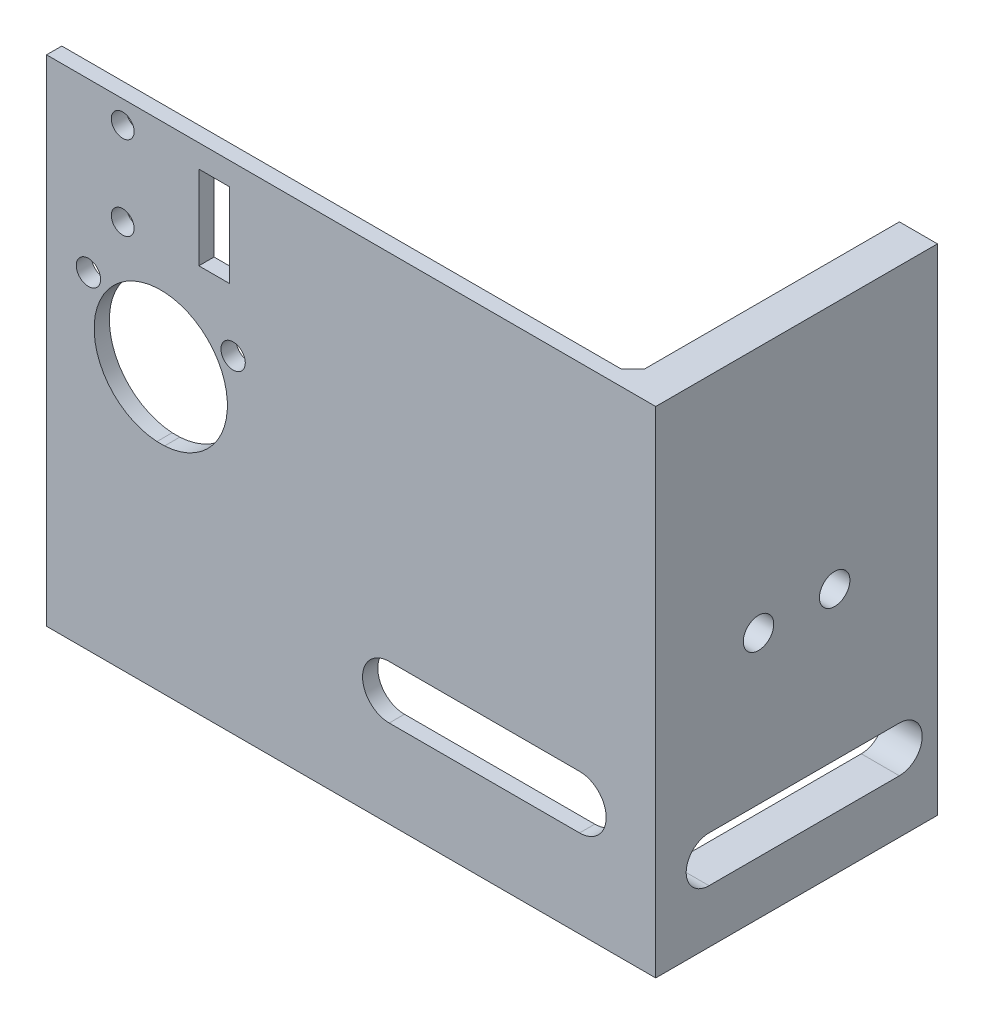
ISO-10303-21;
HEADER;
FILE_DESCRIPTION(('STEP AP214'),'2;1');
FILE_NAME('part.step','',(''),(''),'','','');
FILE_SCHEMA(('AUTOMOTIVE_DESIGN { 1 0 10303 214 1 1 1 1 }'));
ENDSEC;
DATA;
#1=APPLICATION_CONTEXT('core data for automotive mechanical design processes');
#2=APPLICATION_PROTOCOL_DEFINITION('international standard','automotive_design',2000,#1);
#3=PRODUCT_CONTEXT('',#1,'mechanical');
#4=PRODUCT('Part','Part','',(#3));
#5=PRODUCT_RELATED_PRODUCT_CATEGORY('part','',(#4));
#6=PRODUCT_DEFINITION_FORMATION('','',#4);
#7=PRODUCT_DEFINITION_CONTEXT('part definition',#1,'design');
#8=PRODUCT_DEFINITION('design','',#6,#7);
#9=PRODUCT_DEFINITION_SHAPE('','',#8);
#10=(LENGTH_UNIT() NAMED_UNIT(*) SI_UNIT(.MILLI.,.METRE.));
#11=(NAMED_UNIT(*) PLANE_ANGLE_UNIT() SI_UNIT($,.RADIAN.));
#12=(NAMED_UNIT(*) SI_UNIT($,.STERADIAN.) SOLID_ANGLE_UNIT());
#13=UNCERTAINTY_MEASURE_WITH_UNIT(LENGTH_MEASURE(1.E-05),#10,'distance_accuracy_value','');
#14=(GEOMETRIC_REPRESENTATION_CONTEXT(3) GLOBAL_UNCERTAINTY_ASSIGNED_CONTEXT((#13)) GLOBAL_UNIT_ASSIGNED_CONTEXT((#10,
#11,#12)) REPRESENTATION_CONTEXT('',''));
#15=CARTESIAN_POINT('',(0.,0.,0.));
#16=DIRECTION('',(0.,0.,1.));
#17=DIRECTION('',(1.,0.,0.));
#18=AXIS2_PLACEMENT_3D('',#15,#16,#17);
#19=CARTESIAN_POINT('',(0.,13.,-2.));
#20=DIRECTION('',(0.,0.,1.));
#21=DIRECTION('',(1.,0.,0.));
#22=AXIS2_PLACEMENT_3D('',#19,#20,#21);
#23=CYLINDRICAL_SURFACE('',#22,8.75);
#24=DIRECTION('',(0.,0.,1.));
#25=VECTOR('',#24,1.);
#26=CARTESIAN_POINT('',(0.500000000000004,21.7357026048281,-2.));
#27=LINE('',#26,#25);
#28=CARTESIAN_POINT('',(0.500000000000004,21.7357026048281,0.));
#29=VERTEX_POINT('',#28);
#30=CARTESIAN_POINT('',(0.500000000000004,21.7357026048281,-2.));
#31=VERTEX_POINT('',#30);
#32=EDGE_CURVE('E266',#29,#31,#27,.F.);
#33=ORIENTED_EDGE('',*,*,#32,.T.);
#34=CARTESIAN_POINT('',(0.,13.,-2.));
#35=DIRECTION('',(0.,0.,1.));
#36=DIRECTION('',(1.,0.,0.));
#37=AXIS2_PLACEMENT_3D('',#34,#35,#36);
#38=CIRCLE('',#37,8.75);
#39=CARTESIAN_POINT('',(0.499999999999977,4.26429739517194,-2.));
#40=VERTEX_POINT('',#39);
#41=EDGE_CURVE('E315',#40,#31,#38,.T.);
#42=ORIENTED_EDGE('',*,*,#41,.F.);
#43=DIRECTION('',(0.,0.,1.));
#44=VECTOR('',#43,1.);
#45=CARTESIAN_POINT('',(0.499999999999977,4.26429739517194,-1.99999999999999));
#46=LINE('',#45,#44);
#47=CARTESIAN_POINT('',(0.499999999999977,4.26429739517194,0.));
#48=VERTEX_POINT('',#47);
#49=EDGE_CURVE('E332',#40,#48,#46,.T.);
#50=ORIENTED_EDGE('',*,*,#49,.T.);
#51=CARTESIAN_POINT('',(0.,13.,0.));
#52=DIRECTION('',(0.,0.,1.));
#53=DIRECTION('',(1.,0.,0.));
#54=AXIS2_PLACEMENT_3D('',#51,#52,#53);
#55=CIRCLE('',#54,8.75);
#56=EDGE_CURVE('E320',#48,#29,#55,.T.);
#57=ORIENTED_EDGE('',*,*,#56,.T.);
#58=EDGE_LOOP('',(#33,#42,#50,#57));
#59=FACE_BOUND('',#58,.T.);
#60=ADVANCED_FACE('F41',(#59),#23,.F.);
#61=CARTESIAN_POINT('',(-9.5,19.,-2.));
#62=DIRECTION('',(0.,0.,1.));
#63=DIRECTION('',(1.,0.,0.));
#64=AXIS2_PLACEMENT_3D('',#61,#62,#63);
#65=CYLINDRICAL_SURFACE('',#64,1.6);
#66=CARTESIAN_POINT('',(-9.5,19.,-2.));
#67=DIRECTION('',(0.,0.,1.));
#68=DIRECTION('',(1.,0.,0.));
#69=AXIS2_PLACEMENT_3D('',#66,#67,#68);
#70=CIRCLE('',#69,1.6);
#71=CARTESIAN_POINT('',(-7.9,19.,-2.));
#72=VERTEX_POINT('',#71);
#73=EDGE_CURVE('E355',#72,#72,#70,.T.);
#74=ORIENTED_EDGE('',*,*,#73,.F.);
#75=EDGE_LOOP('',(#74));
#76=FACE_BOUND('',#75,.T.);
#77=CARTESIAN_POINT('',(-9.5,19.,0.));
#78=DIRECTION('',(0.,0.,1.));
#79=DIRECTION('',(1.,0.,0.));
#80=AXIS2_PLACEMENT_3D('',#77,#78,#79);
#81=CIRCLE('',#80,1.6);
#82=CARTESIAN_POINT('',(-7.9,19.,0.));
#83=VERTEX_POINT('',#82);
#84=EDGE_CURVE('E352',#83,#83,#81,.T.);
#85=ORIENTED_EDGE('',*,*,#84,.T.);
#86=EDGE_LOOP('',(#85));
#87=FACE_BOUND('',#86,.T.);
#88=ADVANCED_FACE('F435',(#76,#87),#65,.F.);
#89=CARTESIAN_POINT('',(-15.,24.,-2.));
#90=DIRECTION('',(-1.,0.,0.));
#91=DIRECTION('',(0.,-1.,0.));
#92=AXIS2_PLACEMENT_3D('',#89,#90,#91);
#93=PLANE('',#92);
#94=DIRECTION('',(0.,-1.,0.));
#95=VECTOR('',#94,1.);
#96=CARTESIAN_POINT('',(-15.,24.,0.));
#97=LINE('',#96,#95);
#98=CARTESIAN_POINT('',(-15.,41.,0.));
#99=VERTEX_POINT('',#98);
#100=CARTESIAN_POINT('',(-15.,-24.,0.));
#101=VERTEX_POINT('',#100);
#102=EDGE_CURVE('E358',#99,#101,#97,.T.);
#103=ORIENTED_EDGE('',*,*,#102,.F.);
#104=DIRECTION('',(0.,0.,1.));
#105=VECTOR('',#104,1.);
#106=CARTESIAN_POINT('',(-15.,41.,-2.));
#107=LINE('',#106,#105);
#108=CARTESIAN_POINT('',(-15.,41.,-2.));
#109=VERTEX_POINT('',#108);
#110=EDGE_CURVE('E341',#109,#99,#107,.T.);
#111=ORIENTED_EDGE('',*,*,#110,.F.);
#112=DIRECTION('',(0.,-1.,0.));
#113=VECTOR('',#112,1.);
#114=CARTESIAN_POINT('',(-15.,24.,-2.));
#115=LINE('',#114,#113);
#116=CARTESIAN_POINT('',(-15.,-24.,-2.));
#117=VERTEX_POINT('',#116);
#118=EDGE_CURVE('E361',#109,#117,#115,.T.);
#119=ORIENTED_EDGE('',*,*,#118,.T.);
#120=DIRECTION('',(0.,0.,1.));
#121=VECTOR('',#120,1.);
#122=CARTESIAN_POINT('',(-15.,-24.,-2.));
#123=LINE('',#122,#121);
#124=EDGE_CURVE('E368',#117,#101,#123,.T.);
#125=ORIENTED_EDGE('',*,*,#124,.T.);
#126=EDGE_LOOP('',(#103,#111,#119,#125));
#127=FACE_BOUND('',#126,.T.);
#128=ADVANCED_FACE('F441',(#127),#93,.T.);
#129=CARTESIAN_POINT('',(0.,13.,-2.));
#130=DIRECTION('',(0.,0.,1.));
#131=DIRECTION('',(1.,0.,0.));
#132=AXIS2_PLACEMENT_3D('',#129,#130,#131);
#133=CYLINDRICAL_SURFACE('',#132,8.75);
#134=CARTESIAN_POINT('',(0.,13.,0.));
#135=DIRECTION('',(0.,0.,1.));
#136=DIRECTION('',(1.,0.,0.));
#137=AXIS2_PLACEMENT_3D('',#134,#135,#136);
#138=CIRCLE('',#137,8.75);
#139=CARTESIAN_POINT('',(-0.5,21.7357026048281,0.));
#140=VERTEX_POINT('',#139);
#141=CARTESIAN_POINT('',(-0.5,4.26429739517194,0.));
#142=VERTEX_POINT('',#141);
#143=EDGE_CURVE('E348',#140,#142,#138,.T.);
#144=ORIENTED_EDGE('',*,*,#143,.T.);
#145=DIRECTION('',(0.,0.,1.));
#146=VECTOR('',#145,1.);
#147=CARTESIAN_POINT('',(-0.5,4.26429739517194,-2.));
#148=LINE('',#147,#146);
#149=CARTESIAN_POINT('',(-0.5,4.26429739517194,-2.));
#150=VERTEX_POINT('',#149);
#151=EDGE_CURVE('E338',#142,#150,#148,.F.);
#152=ORIENTED_EDGE('',*,*,#151,.T.);
#153=CARTESIAN_POINT('',(0.,13.,-2.));
#154=DIRECTION('',(0.,0.,1.));
#155=DIRECTION('',(1.,0.,0.));
#156=AXIS2_PLACEMENT_3D('',#153,#154,#155);
#157=CIRCLE('',#156,8.75);
#158=CARTESIAN_POINT('',(-0.5,21.7357026048281,-2.));
#159=VERTEX_POINT('',#158);
#160=EDGE_CURVE('E349',#159,#150,#157,.T.);
#161=ORIENTED_EDGE('',*,*,#160,.F.);
#162=DIRECTION('',(0.,0.,1.));
#163=VECTOR('',#162,1.);
#164=CARTESIAN_POINT('',(-0.5,21.7357026048281,-2.));
#165=LINE('',#164,#163);
#166=EDGE_CURVE('E335',#159,#140,#165,.T.);
#167=ORIENTED_EDGE('',*,*,#166,.T.);
#168=EDGE_LOOP('',(#144,#152,#161,#167));
#169=FACE_BOUND('',#168,.T.);
#170=ADVANCED_FACE('F456',(#169),#133,.F.);
#171=CARTESIAN_POINT('',(0.,41.,0.));
#172=DIRECTION('',(0.,1.,0.));
#173=DIRECTION('',(0.,0.,1.));
#174=AXIS2_PLACEMENT_3D('',#171,#172,#173);
#175=PLANE('',#174);
#176=DIRECTION('',(1.,0.,0.));
#177=VECTOR('',#176,1.);
#178=CARTESIAN_POINT('',(-15.,41.,0.));
#179=LINE('',#178,#177);
#180=CARTESIAN_POINT('',(65.,41.,0.));
#181=VERTEX_POINT('',#180);
#182=EDGE_CURVE('E344',#99,#181,#179,.T.);
#183=ORIENTED_EDGE('',*,*,#182,.T.);
#184=DIRECTION('',(0.,0.,1.));
#185=VECTOR('',#184,1.);
#186=CARTESIAN_POINT('',(65.,41.,-2.));
#187=LINE('',#186,#185);
#188=CARTESIAN_POINT('',(65.,41.,-37.));
#189=VERTEX_POINT('',#188);
#190=EDGE_CURVE('E304',#189,#181,#187,.T.);
#191=ORIENTED_EDGE('',*,*,#190,.F.);
#192=DIRECTION('',(1.,0.,0.));
#193=VECTOR('',#192,1.);
#194=CARTESIAN_POINT('',(65.,41.,-37.));
#195=LINE('',#194,#193);
#196=CARTESIAN_POINT('',(60.,41.,-37.));
#197=VERTEX_POINT('',#196);
#198=EDGE_CURVE('E289',#197,#189,#195,.T.);
#199=ORIENTED_EDGE('',*,*,#198,.F.);
#200=DIRECTION('',(0.,0.,1.));
#201=VECTOR('',#200,1.);
#202=CARTESIAN_POINT('',(60.,41.,-37.));
#203=LINE('',#202,#201);
#204=CARTESIAN_POINT('',(60.,41.,-3.50000000000002));
#205=VERTEX_POINT('',#204);
#206=EDGE_CURVE('E301',#197,#205,#203,.T.);
#207=ORIENTED_EDGE('',*,*,#206,.T.);
#208=DIRECTION('',(0.707106781186546,0.,-0.707106781186549));
#209=VECTOR('',#208,1.);
#210=CARTESIAN_POINT('',(60.,41.,-3.50000000000002));
#211=LINE('',#210,#209);
#212=CARTESIAN_POINT('',(58.5,41.,-2.));
#213=VERTEX_POINT('',#212);
#214=EDGE_CURVE('E405',#205,#213,#211,.F.);
#215=ORIENTED_EDGE('',*,*,#214,.T.);
#216=DIRECTION('',(-1.,0.,0.));
#217=VECTOR('',#216,1.);
#218=CARTESIAN_POINT('',(15.,41.,-2.));
#219=LINE('',#218,#217);
#220=EDGE_CURVE('E346',#213,#109,#219,.T.);
#221=ORIENTED_EDGE('',*,*,#220,.T.);
#222=ORIENTED_EDGE('',*,*,#110,.T.);
#223=EDGE_LOOP('',(#183,#191,#199,#207,#215,#221,#222));
#224=FACE_BOUND('',#223,.T.);
#225=ADVANCED_FACE('F453',(#224),#175,.T.);
#226=CARTESIAN_POINT('',(0.,0.,0.));
#227=DIRECTION('',(0.,0.,1.));
#228=DIRECTION('',(1.,0.,0.));
#229=AXIS2_PLACEMENT_3D('',#226,#227,#228);
#230=PLANE('',#229);
#231=DIRECTION('',(0.,-1.,0.));
#232=VECTOR('',#231,1.);
#233=CARTESIAN_POINT('',(5.,38.,0.));
#234=LINE('',#233,#232);
#235=CARTESIAN_POINT('',(5.,38.,0.));
#236=VERTEX_POINT('',#235);
#237=CARTESIAN_POINT('',(5.,27.,0.));
#238=VERTEX_POINT('',#237);
#239=EDGE_CURVE('E57',#236,#238,#234,.T.);
#240=ORIENTED_EDGE('',*,*,#239,.F.);
#241=DIRECTION('',(-1.,0.,0.));
#242=VECTOR('',#241,1.);
#243=CARTESIAN_POINT('',(5.,38.,0.));
#244=LINE('',#243,#242);
#245=CARTESIAN_POINT('',(9.,38.,0.));
#246=VERTEX_POINT('',#245);
#247=EDGE_CURVE('E207',#246,#236,#244,.T.);
#248=ORIENTED_EDGE('',*,*,#247,.F.);
#249=DIRECTION('',(0.,1.,0.));
#250=VECTOR('',#249,1.);
#251=CARTESIAN_POINT('',(9.,38.,0.));
#252=LINE('',#251,#250);
#253=CARTESIAN_POINT('',(9.,27.,0.));
#254=VERTEX_POINT('',#253);
#255=EDGE_CURVE('E213',#254,#246,#252,.T.);
#256=ORIENTED_EDGE('',*,*,#255,.F.);
#257=DIRECTION('',(1.,0.,0.));
#258=VECTOR('',#257,1.);
#259=CARTESIAN_POINT('',(5.,27.,0.));
#260=LINE('',#259,#258);
#261=EDGE_CURVE('E219',#238,#254,#260,.T.);
#262=ORIENTED_EDGE('',*,*,#261,.F.);
#263=EDGE_LOOP('',(#240,#248,#256,#262));
#264=FACE_BOUND('',#263,.T.);
#265=CARTESIAN_POINT('',(-5.,27.,0.));
#266=DIRECTION('',(0.,0.,1.));
#267=DIRECTION('',(1.,0.,0.));
#268=AXIS2_PLACEMENT_3D('',#265,#266,#267);
#269=CIRCLE('',#268,1.5);
#270=CARTESIAN_POINT('',(-3.5,27.,0.));
#271=VERTEX_POINT('',#270);
#272=EDGE_CURVE('E220',#271,#271,#269,.T.);
#273=ORIENTED_EDGE('',*,*,#272,.F.);
#274=EDGE_LOOP('',(#273));
#275=FACE_BOUND('',#274,.T.);
#276=CARTESIAN_POINT('',(-5.,38.,0.));
#277=DIRECTION('',(0.,0.,1.));
#278=DIRECTION('',(1.,0.,0.));
#279=AXIS2_PLACEMENT_3D('',#276,#277,#278);
#280=CIRCLE('',#279,1.5);
#281=CARTESIAN_POINT('',(-3.5,38.,0.));
#282=VERTEX_POINT('',#281);
#283=EDGE_CURVE('E223',#282,#282,#280,.T.);
#284=ORIENTED_EDGE('',*,*,#283,.F.);
#285=EDGE_LOOP('',(#284));
#286=FACE_BOUND('',#285,.T.);
#287=CARTESIAN_POINT('',(30.,-9.,0.));
#288=DIRECTION('',(0.,0.,1.));
#289=DIRECTION('',(1.,0.,0.));
#290=AXIS2_PLACEMENT_3D('',#287,#288,#289);
#291=CIRCLE('',#290,3.5);
#292=CARTESIAN_POINT('',(30.,-5.5,0.));
#293=VERTEX_POINT('',#292);
#294=CARTESIAN_POINT('',(30.,-12.5,0.));
#295=VERTEX_POINT('',#294);
#296=EDGE_CURVE('E246',#293,#295,#291,.T.);
#297=ORIENTED_EDGE('',*,*,#296,.F.);
#298=DIRECTION('',(-1.,0.,0.));
#299=VECTOR('',#298,1.);
#300=CARTESIAN_POINT('',(30.,-5.5,0.));
#301=LINE('',#300,#299);
#302=CARTESIAN_POINT('',(55.,-5.5,0.));
#303=VERTEX_POINT('',#302);
#304=EDGE_CURVE('E260',#303,#293,#301,.T.);
#305=ORIENTED_EDGE('',*,*,#304,.F.);
#306=CARTESIAN_POINT('',(55.,-9.,0.));
#307=DIRECTION('',(0.,0.,1.));
#308=DIRECTION('',(1.,0.,0.));
#309=AXIS2_PLACEMENT_3D('',#306,#307,#308);
#310=CIRCLE('',#309,3.5);
#311=CARTESIAN_POINT('',(55.,-12.5,0.));
#312=VERTEX_POINT('',#311);
#313=EDGE_CURVE('E257',#312,#303,#310,.T.);
#314=ORIENTED_EDGE('',*,*,#313,.F.);
#315=DIRECTION('',(1.,0.,0.));
#316=VECTOR('',#315,1.);
#317=CARTESIAN_POINT('',(30.,-12.5,0.));
#318=LINE('',#317,#316);
#319=EDGE_CURVE('E254',#295,#312,#318,.T.);
#320=ORIENTED_EDGE('',*,*,#319,.F.);
#321=EDGE_LOOP('',(#297,#305,#314,#320));
#322=FACE_BOUND('',#321,.T.);
#323=ORIENTED_EDGE('',*,*,#143,.F.);
#324=DIRECTION('',(-1.,0.,0.));
#325=VECTOR('',#324,1.);
#326=CARTESIAN_POINT('',(65.002,21.7357026048281,0.));
#327=LINE('',#326,#325);
#328=EDGE_CURVE('E275',#29,#140,#327,.T.);
#329=ORIENTED_EDGE('',*,*,#328,.F.);
#330=ORIENTED_EDGE('',*,*,#56,.F.);
#331=DIRECTION('',(-1.,0.,0.));
#332=VECTOR('',#331,1.);
#333=CARTESIAN_POINT('',(65.002,4.26429739517194,0.));
#334=LINE('',#333,#332);
#335=EDGE_CURVE('E330',#48,#142,#334,.T.);
#336=ORIENTED_EDGE('',*,*,#335,.T.);
#337=EDGE_LOOP('',(#323,#329,#330,#336));
#338=FACE_BOUND('',#337,.T.);
#339=DIRECTION('',(0.,-1.,0.));
#340=VECTOR('',#339,1.);
#341=CARTESIAN_POINT('',(65.,41.,0.));
#342=LINE('',#341,#340);
#343=CARTESIAN_POINT('',(65.,-24.,0.));
#344=VERTEX_POINT('',#343);
#345=EDGE_CURVE('E307',#181,#344,#342,.T.);
#346=ORIENTED_EDGE('',*,*,#345,.F.);
#347=ORIENTED_EDGE('',*,*,#182,.F.);
#348=ORIENTED_EDGE('',*,*,#102,.T.);
#349=DIRECTION('',(1.,0.,0.));
#350=VECTOR('',#349,1.);
#351=CARTESIAN_POINT('',(-15.,-24.,0.));
#352=LINE('',#351,#350);
#353=EDGE_CURVE('E365',#101,#344,#352,.T.);
#354=ORIENTED_EDGE('',*,*,#353,.T.);
#355=EDGE_LOOP('',(#346,#347,#348,#354));
#356=FACE_BOUND('',#355,.T.);
#357=ORIENTED_EDGE('',*,*,#84,.F.);
#358=EDGE_LOOP('',(#357));
#359=FACE_BOUND('',#358,.T.);
#360=CARTESIAN_POINT('',(9.50000000000001,19.,0.));
#361=DIRECTION('',(0.,0.,1.));
#362=DIRECTION('',(1.,0.,0.));
#363=AXIS2_PLACEMENT_3D('',#360,#361,#362);
#364=CIRCLE('',#363,1.6);
#365=CARTESIAN_POINT('',(11.1,19.,0.));
#366=VERTEX_POINT('',#365);
#367=EDGE_CURVE('E316',#366,#366,#364,.T.);
#368=ORIENTED_EDGE('',*,*,#367,.F.);
#369=EDGE_LOOP('',(#368));
#370=FACE_BOUND('',#369,.T.);
#371=ADVANCED_FACE('F217',(#264,#275,#286,#322,#338,#356,#359,#370),#230,.T.);
#372=CARTESIAN_POINT('',(0.,0.,-2.));
#373=DIRECTION('',(0.,0.,1.));
#374=DIRECTION('',(1.,0.,0.));
#375=AXIS2_PLACEMENT_3D('',#372,#373,#374);
#376=PLANE('',#375);
#377=DIRECTION('',(-1.,0.,0.));
#378=VECTOR('',#377,1.);
#379=CARTESIAN_POINT('',(0.,38.,-2.));
#380=LINE('',#379,#378);
#381=CARTESIAN_POINT('',(9.,38.,-2.));
#382=VERTEX_POINT('',#381);
#383=CARTESIAN_POINT('',(5.,38.,-2.));
#384=VERTEX_POINT('',#383);
#385=EDGE_CURVE('E50',#382,#384,#380,.T.);
#386=ORIENTED_EDGE('',*,*,#385,.T.);
#387=DIRECTION('',(0.,-1.,0.));
#388=VECTOR('',#387,1.);
#389=CARTESIAN_POINT('',(5.,0.,-2.));
#390=LINE('',#389,#388);
#391=CARTESIAN_POINT('',(5.,27.,-2.));
#392=VERTEX_POINT('',#391);
#393=EDGE_CURVE('E11',#384,#392,#390,.T.);
#394=ORIENTED_EDGE('',*,*,#393,.T.);
#395=DIRECTION('',(1.,0.,0.));
#396=VECTOR('',#395,1.);
#397=CARTESIAN_POINT('',(0.,27.,-2.));
#398=LINE('',#397,#396);
#399=CARTESIAN_POINT('',(9.,27.,-2.));
#400=VERTEX_POINT('',#399);
#401=EDGE_CURVE('E409',#392,#400,#398,.T.);
#402=ORIENTED_EDGE('',*,*,#401,.T.);
#403=DIRECTION('',(0.,1.,0.));
#404=VECTOR('',#403,1.);
#405=CARTESIAN_POINT('',(9.,0.,-2.));
#406=LINE('',#405,#404);
#407=EDGE_CURVE('E416',#400,#382,#406,.T.);
#408=ORIENTED_EDGE('',*,*,#407,.T.);
#409=EDGE_LOOP('',(#386,#394,#402,#408));
#410=FACE_BOUND('',#409,.T.);
#411=CARTESIAN_POINT('',(-5.,27.,-2.));
#412=DIRECTION('',(0.,0.,1.));
#413=DIRECTION('',(1.,0.,0.));
#414=AXIS2_PLACEMENT_3D('',#411,#412,#413);
#415=CIRCLE('',#414,1.5);
#416=CARTESIAN_POINT('',(-3.5,27.,-2.));
#417=VERTEX_POINT('',#416);
#418=EDGE_CURVE('E234',#417,#417,#415,.T.);
#419=ORIENTED_EDGE('',*,*,#418,.T.);
#420=EDGE_LOOP('',(#419));
#421=FACE_BOUND('',#420,.T.);
#422=CARTESIAN_POINT('',(-5.,38.,-2.));
#423=DIRECTION('',(0.,0.,1.));
#424=DIRECTION('',(1.,0.,0.));
#425=AXIS2_PLACEMENT_3D('',#422,#423,#424);
#426=CIRCLE('',#425,1.5);
#427=CARTESIAN_POINT('',(-3.5,38.,-2.));
#428=VERTEX_POINT('',#427);
#429=EDGE_CURVE('E230',#428,#428,#426,.T.);
#430=ORIENTED_EDGE('',*,*,#429,.T.);
#431=EDGE_LOOP('',(#430));
#432=FACE_BOUND('',#431,.T.);
#433=ORIENTED_EDGE('',*,*,#220,.F.);
#434=DIRECTION('',(0.,-1.,0.));
#435=VECTOR('',#434,1.);
#436=CARTESIAN_POINT('',(58.5,-24.,-2.));
#437=LINE('',#436,#435);
#438=CARTESIAN_POINT('',(58.5,-9.,-2.));
#439=VERTEX_POINT('',#438);
#440=EDGE_CURVE('E403',#213,#439,#437,.T.);
#441=ORIENTED_EDGE('',*,*,#440,.T.);
#442=CARTESIAN_POINT('',(55.,-9.,-2.));
#443=DIRECTION('',(0.,0.,1.));
#444=DIRECTION('',(1.,0.,0.));
#445=AXIS2_PLACEMENT_3D('',#442,#443,#444);
#446=CIRCLE('',#445,3.5);
#447=CARTESIAN_POINT('',(55.,-5.5,-2.));
#448=VERTEX_POINT('',#447);
#449=EDGE_CURVE('E376',#439,#448,#446,.T.);
#450=ORIENTED_EDGE('',*,*,#449,.T.);
#451=DIRECTION('',(-1.,0.,0.));
#452=VECTOR('',#451,1.);
#453=CARTESIAN_POINT('',(0.,-5.5,-2.));
#454=LINE('',#453,#452);
#455=CARTESIAN_POINT('',(30.,-5.5,-2.));
#456=VERTEX_POINT('',#455);
#457=EDGE_CURVE('E380',#448,#456,#454,.T.);
#458=ORIENTED_EDGE('',*,*,#457,.T.);
#459=CARTESIAN_POINT('',(30.,-9.,-2.));
#460=DIRECTION('',(0.,0.,1.));
#461=DIRECTION('',(1.,0.,0.));
#462=AXIS2_PLACEMENT_3D('',#459,#460,#461);
#463=CIRCLE('',#462,3.5);
#464=CARTESIAN_POINT('',(30.,-12.5,-2.));
#465=VERTEX_POINT('',#464);
#466=EDGE_CURVE('E383',#456,#465,#463,.T.);
#467=ORIENTED_EDGE('',*,*,#466,.T.);
#468=DIRECTION('',(1.,0.,0.));
#469=VECTOR('',#468,1.);
#470=CARTESIAN_POINT('',(0.,-12.5,-2.));
#471=LINE('',#470,#469);
#472=CARTESIAN_POINT('',(55.,-12.5,-2.));
#473=VERTEX_POINT('',#472);
#474=EDGE_CURVE('E373',#465,#473,#471,.T.);
#475=ORIENTED_EDGE('',*,*,#474,.T.);
#476=EDGE_CURVE('E377',#473,#439,#446,.T.);
#477=ORIENTED_EDGE('',*,*,#476,.T.);
#478=DIRECTION('',(0.,-1.,0.));
#479=VECTOR('',#478,1.);
#480=CARTESIAN_POINT('',(58.5,-24.,-2.));
#481=LINE('',#480,#479);
#482=CARTESIAN_POINT('',(58.5,-24.,-2.));
#483=VERTEX_POINT('',#482);
#484=EDGE_CURVE('E401',#439,#483,#481,.T.);
#485=ORIENTED_EDGE('',*,*,#484,.T.);
#486=DIRECTION('',(1.,0.,0.));
#487=VECTOR('',#486,1.);
#488=CARTESIAN_POINT('',(-15.,-24.,-2.));
#489=LINE('',#488,#487);
#490=EDGE_CURVE('E364',#117,#483,#489,.T.);
#491=ORIENTED_EDGE('',*,*,#490,.F.);
#492=ORIENTED_EDGE('',*,*,#118,.F.);
#493=EDGE_LOOP('',(#433,#441,#450,#458,#467,#475,#477,#485,#491,#492));
#494=FACE_BOUND('',#493,.T.);
#495=DIRECTION('',(-1.,0.,0.));
#496=VECTOR('',#495,1.);
#497=CARTESIAN_POINT('',(65.002,21.7357026048281,-2.));
#498=LINE('',#497,#496);
#499=EDGE_CURVE('E273',#31,#159,#498,.T.);
#500=ORIENTED_EDGE('',*,*,#499,.T.);
#501=ORIENTED_EDGE('',*,*,#160,.T.);
#502=DIRECTION('',(-1.,0.,0.));
#503=VECTOR('',#502,1.);
#504=CARTESIAN_POINT('',(65.002,4.26429739517194,-2.));
#505=LINE('',#504,#503);
#506=EDGE_CURVE('E319',#40,#150,#505,.T.);
#507=ORIENTED_EDGE('',*,*,#506,.F.);
#508=ORIENTED_EDGE('',*,*,#41,.T.);
#509=EDGE_LOOP('',(#500,#501,#507,#508));
#510=FACE_BOUND('',#509,.T.);
#511=ORIENTED_EDGE('',*,*,#73,.T.);
#512=EDGE_LOOP('',(#511));
#513=FACE_BOUND('',#512,.T.);
#514=CARTESIAN_POINT('',(9.50000000000001,19.,-2.));
#515=DIRECTION('',(0.,0.,1.));
#516=DIRECTION('',(1.,0.,0.));
#517=AXIS2_PLACEMENT_3D('',#514,#515,#516);
#518=CIRCLE('',#517,1.6);
#519=CARTESIAN_POINT('',(11.1,19.,-2.));
#520=VERTEX_POINT('',#519);
#521=EDGE_CURVE('E312',#520,#520,#518,.T.);
#522=ORIENTED_EDGE('',*,*,#521,.T.);
#523=EDGE_LOOP('',(#522));
#524=FACE_BOUND('',#523,.T.);
#525=ADVANCED_FACE('F419',(#410,#421,#432,#494,#510,#513,#524),#376,.F.);
#526=CARTESIAN_POINT('',(-15.,-24.,-2.));
#527=DIRECTION('',(0.,-1.,0.));
#528=DIRECTION('',(0.,0.,-1.));
#529=AXIS2_PLACEMENT_3D('',#526,#527,#528);
#530=PLANE('',#529);
#531=ORIENTED_EDGE('',*,*,#490,.T.);
#532=DIRECTION('',(-0.707106781186546,0.,0.707106781186549));
#533=VECTOR('',#532,1.);
#534=CARTESIAN_POINT('',(60.,-24.,-3.50000000000002));
#535=LINE('',#534,#533);
#536=CARTESIAN_POINT('',(60.,-24.,-3.50000000000002));
#537=VERTEX_POINT('',#536);
#538=EDGE_CURVE('E407',#483,#537,#535,.F.);
#539=ORIENTED_EDGE('',*,*,#538,.T.);
#540=DIRECTION('',(0.,0.,1.));
#541=VECTOR('',#540,1.);
#542=CARTESIAN_POINT('',(60.,-24.,-37.));
#543=LINE('',#542,#541);
#544=CARTESIAN_POINT('',(60.,-24.,-37.));
#545=VERTEX_POINT('',#544);
#546=EDGE_CURVE('E298',#545,#537,#543,.T.);
#547=ORIENTED_EDGE('',*,*,#546,.F.);
#548=DIRECTION('',(-1.,0.,0.));
#549=VECTOR('',#548,1.);
#550=CARTESIAN_POINT('',(65.,-24.,-37.));
#551=LINE('',#550,#549);
#552=CARTESIAN_POINT('',(65.,-24.,-37.));
#553=VERTEX_POINT('',#552);
#554=EDGE_CURVE('E296',#553,#545,#551,.T.);
#555=ORIENTED_EDGE('',*,*,#554,.F.);
#556=DIRECTION('',(0.,0.,-1.));
#557=VECTOR('',#556,1.);
#558=CARTESIAN_POINT('',(65.,-24.,0.));
#559=LINE('',#558,#557);
#560=EDGE_CURVE('E310',#344,#553,#559,.T.);
#561=ORIENTED_EDGE('',*,*,#560,.F.);
#562=ORIENTED_EDGE('',*,*,#353,.F.);
#563=ORIENTED_EDGE('',*,*,#124,.F.);
#564=EDGE_LOOP('',(#531,#539,#547,#555,#561,#562,#563));
#565=FACE_BOUND('',#564,.T.);
#566=ADVANCED_FACE('F451',(#565),#530,.T.);
#567=CARTESIAN_POINT('',(65.002,4.26429739517194,-2.));
#568=DIRECTION('',(0.,-1.,0.));
#569=DIRECTION('',(0.,0.,-1.));
#570=AXIS2_PLACEMENT_3D('',#567,#568,#569);
#571=PLANE('',#570);
#572=ORIENTED_EDGE('',*,*,#49,.F.);
#573=ORIENTED_EDGE('',*,*,#506,.T.);
#574=ORIENTED_EDGE('',*,*,#151,.F.);
#575=ORIENTED_EDGE('',*,*,#335,.F.);
#576=EDGE_LOOP('',(#572,#573,#574,#575));
#577=FACE_BOUND('',#576,.T.);
#578=ADVANCED_FACE('F448',(#577),#571,.F.);
#579=CARTESIAN_POINT('',(9.50000000000001,19.,-2.));
#580=DIRECTION('',(0.,0.,1.));
#581=DIRECTION('',(1.,0.,0.));
#582=AXIS2_PLACEMENT_3D('',#579,#580,#581);
#583=CYLINDRICAL_SURFACE('',#582,1.6);
#584=ORIENTED_EDGE('',*,*,#521,.F.);
#585=EDGE_LOOP('',(#584));
#586=FACE_BOUND('',#585,.T.);
#587=ORIENTED_EDGE('',*,*,#367,.T.);
#588=EDGE_LOOP('',(#587));
#589=FACE_BOUND('',#588,.T.);
#590=ADVANCED_FACE('F446',(#586,#589),#583,.F.);
#591=CARTESIAN_POINT('',(65.,0.,0.));
#592=DIRECTION('',(1.,0.,0.));
#593=DIRECTION('',(0.,1.,0.));
#594=AXIS2_PLACEMENT_3D('',#591,#592,#593);
#595=PLANE('',#594);
#596=CARTESIAN_POINT('',(65.,-14.,-7.00000000000001));
#597=DIRECTION('',(1.,0.,0.));
#598=DIRECTION('',(0.,1.,0.));
#599=AXIS2_PLACEMENT_3D('',#596,#597,#598);
#600=CIRCLE('',#599,3.);
#601=CARTESIAN_POINT('',(65.,-11.,-7.00000000000001));
#602=VERTEX_POINT('',#601);
#603=CARTESIAN_POINT('',(65.,-17.,-7.00000000000001));
#604=VERTEX_POINT('',#603);
#605=EDGE_CURVE('E231',#602,#604,#600,.T.);
#606=ORIENTED_EDGE('',*,*,#605,.F.);
#607=DIRECTION('',(0.,0.,1.));
#608=VECTOR('',#607,1.);
#609=CARTESIAN_POINT('',(65.,-11.,-7.00000000000001));
#610=LINE('',#609,#608);
#611=CARTESIAN_POINT('',(65.,-11.,-32.));
#612=VERTEX_POINT('',#611);
#613=EDGE_CURVE('E240',#612,#602,#610,.T.);
#614=ORIENTED_EDGE('',*,*,#613,.F.);
#615=CARTESIAN_POINT('',(65.,-14.,-32.));
#616=DIRECTION('',(1.,0.,0.));
#617=DIRECTION('',(0.,1.,0.));
#618=AXIS2_PLACEMENT_3D('',#615,#616,#617);
#619=CIRCLE('',#618,3.);
#620=CARTESIAN_POINT('',(65.,-17.,-32.));
#621=VERTEX_POINT('',#620);
#622=EDGE_CURVE('E237',#621,#612,#619,.T.);
#623=ORIENTED_EDGE('',*,*,#622,.F.);
#624=DIRECTION('',(0.,0.,-1.));
#625=VECTOR('',#624,1.);
#626=CARTESIAN_POINT('',(65.,-17.,-7.00000000000001));
#627=LINE('',#626,#625);
#628=EDGE_CURVE('E233',#604,#621,#627,.T.);
#629=ORIENTED_EDGE('',*,*,#628,.F.);
#630=EDGE_LOOP('',(#606,#614,#623,#629));
#631=FACE_BOUND('',#630,.T.);
#632=CARTESIAN_POINT('',(65.,8.50000000000001,-13.5));
#633=DIRECTION('',(1.,0.,0.));
#634=DIRECTION('',(0.,1.,0.));
#635=AXIS2_PLACEMENT_3D('',#632,#633,#634);
#636=CIRCLE('',#635,2.);
#637=CARTESIAN_POINT('',(65.,10.5,-13.5));
#638=VERTEX_POINT('',#637);
#639=EDGE_CURVE('E280',#638,#638,#636,.T.);
#640=ORIENTED_EDGE('',*,*,#639,.F.);
#641=EDGE_LOOP('',(#640));
#642=FACE_BOUND('',#641,.T.);
#643=CARTESIAN_POINT('',(65.,8.50000000000001,-23.5));
#644=DIRECTION('',(1.,0.,0.));
#645=DIRECTION('',(0.,1.,0.));
#646=AXIS2_PLACEMENT_3D('',#643,#644,#645);
#647=CIRCLE('',#646,2.);
#648=CARTESIAN_POINT('',(65.,10.5,-23.5));
#649=VERTEX_POINT('',#648);
#650=EDGE_CURVE('E277',#649,#649,#647,.T.);
#651=ORIENTED_EDGE('',*,*,#650,.F.);
#652=EDGE_LOOP('',(#651));
#653=FACE_BOUND('',#652,.T.);
#654=ORIENTED_EDGE('',*,*,#190,.T.);
#655=ORIENTED_EDGE('',*,*,#345,.T.);
#656=ORIENTED_EDGE('',*,*,#560,.T.);
#657=DIRECTION('',(0.,-1.,0.));
#658=VECTOR('',#657,1.);
#659=CARTESIAN_POINT('',(65.,41.,-37.));
#660=LINE('',#659,#658);
#661=EDGE_CURVE('E293',#189,#553,#660,.T.);
#662=ORIENTED_EDGE('',*,*,#661,.F.);
#663=EDGE_LOOP('',(#654,#655,#656,#662));
#664=FACE_BOUND('',#663,.T.);
#665=ADVANCED_FACE('F498',(#631,#642,#653,#664),#595,.T.);
#666=CARTESIAN_POINT('',(60.,41.,-37.));
#667=DIRECTION('',(1.,0.,0.));
#668=DIRECTION('',(0.,1.,0.));
#669=AXIS2_PLACEMENT_3D('',#666,#667,#668);
#670=PLANE('',#669);
#671=DIRECTION('',(0.,0.,1.));
#672=VECTOR('',#671,1.);
#673=CARTESIAN_POINT('',(60.,-11.,-37.));
#674=LINE('',#673,#672);
#675=CARTESIAN_POINT('',(60.,-11.,-32.));
#676=VERTEX_POINT('',#675);
#677=CARTESIAN_POINT('',(60.,-11.,-7.00000000000001));
#678=VERTEX_POINT('',#677);
#679=EDGE_CURVE('E392',#676,#678,#674,.T.);
#680=ORIENTED_EDGE('',*,*,#679,.T.);
#681=CARTESIAN_POINT('',(60.,-14.,-7.00000000000001));
#682=DIRECTION('',(1.,0.,0.));
#683=DIRECTION('',(0.,1.,0.));
#684=AXIS2_PLACEMENT_3D('',#681,#682,#683);
#685=CIRCLE('',#684,3.);
#686=CARTESIAN_POINT('',(60.,-17.,-7.00000000000001));
#687=VERTEX_POINT('',#686);
#688=EDGE_CURVE('E395',#678,#687,#685,.T.);
#689=ORIENTED_EDGE('',*,*,#688,.T.);
#690=DIRECTION('',(0.,0.,-1.));
#691=VECTOR('',#690,1.);
#692=CARTESIAN_POINT('',(60.,-17.,-37.));
#693=LINE('',#692,#691);
#694=CARTESIAN_POINT('',(60.,-17.,-32.));
#695=VERTEX_POINT('',#694);
#696=EDGE_CURVE('E386',#687,#695,#693,.T.);
#697=ORIENTED_EDGE('',*,*,#696,.T.);
#698=CARTESIAN_POINT('',(60.,-14.,-32.));
#699=DIRECTION('',(1.,0.,0.));
#700=DIRECTION('',(0.,1.,0.));
#701=AXIS2_PLACEMENT_3D('',#698,#699,#700);
#702=CIRCLE('',#701,3.);
#703=EDGE_CURVE('E389',#695,#676,#702,.T.);
#704=ORIENTED_EDGE('',*,*,#703,.T.);
#705=EDGE_LOOP('',(#680,#689,#697,#704));
#706=FACE_BOUND('',#705,.T.);
#707=CARTESIAN_POINT('',(60.,8.50000000000001,-13.5));
#708=DIRECTION('',(1.,0.,0.));
#709=DIRECTION('',(0.,1.,0.));
#710=AXIS2_PLACEMENT_3D('',#707,#708,#709);
#711=CIRCLE('',#710,2.);
#712=CARTESIAN_POINT('',(60.,10.5,-13.5));
#713=VERTEX_POINT('',#712);
#714=EDGE_CURVE('E290',#713,#713,#711,.T.);
#715=ORIENTED_EDGE('',*,*,#714,.T.);
#716=EDGE_LOOP('',(#715));
#717=FACE_BOUND('',#716,.T.);
#718=CARTESIAN_POINT('',(60.,8.50000000000001,-23.5));
#719=DIRECTION('',(1.,0.,0.));
#720=DIRECTION('',(0.,1.,0.));
#721=AXIS2_PLACEMENT_3D('',#718,#719,#720);
#722=CIRCLE('',#721,2.);
#723=CARTESIAN_POINT('',(60.,10.5,-23.5));
#724=VERTEX_POINT('',#723);
#725=EDGE_CURVE('E283',#724,#724,#722,.T.);
#726=ORIENTED_EDGE('',*,*,#725,.T.);
#727=EDGE_LOOP('',(#726));
#728=FACE_BOUND('',#727,.T.);
#729=ORIENTED_EDGE('',*,*,#546,.T.);
#730=DIRECTION('',(0.,1.,0.));
#731=VECTOR('',#730,1.);
#732=CARTESIAN_POINT('',(60.,41.,-3.50000000000002));
#733=LINE('',#732,#731);
#734=EDGE_CURVE('E398',#537,#205,#733,.T.);
#735=ORIENTED_EDGE('',*,*,#734,.T.);
#736=ORIENTED_EDGE('',*,*,#206,.F.);
#737=DIRECTION('',(0.,1.,0.));
#738=VECTOR('',#737,1.);
#739=CARTESIAN_POINT('',(60.,41.,-37.));
#740=LINE('',#739,#738);
#741=EDGE_CURVE('E286',#545,#197,#740,.T.);
#742=ORIENTED_EDGE('',*,*,#741,.F.);
#743=EDGE_LOOP('',(#729,#735,#736,#742));
#744=FACE_BOUND('',#743,.T.);
#745=ADVANCED_FACE('F490',(#706,#717,#728,#744),#670,.F.);
#746=CARTESIAN_POINT('',(0.,0.,-37.));
#747=DIRECTION('',(0.,0.,-1.));
#748=DIRECTION('',(-1.,0.,0.));
#749=AXIS2_PLACEMENT_3D('',#746,#747,#748);
#750=PLANE('',#749);
#751=ORIENTED_EDGE('',*,*,#741,.T.);
#752=ORIENTED_EDGE('',*,*,#198,.T.);
#753=ORIENTED_EDGE('',*,*,#661,.T.);
#754=ORIENTED_EDGE('',*,*,#554,.T.);
#755=EDGE_LOOP('',(#751,#752,#753,#754));
#756=FACE_BOUND('',#755,.T.);
#757=ADVANCED_FACE('F494',(#756),#750,.T.);
#758=CARTESIAN_POINT('',(30.,8.50000000000001,-23.5));
#759=DIRECTION('',(1.,0.,0.));
#760=DIRECTION('',(0.,1.,0.));
#761=AXIS2_PLACEMENT_3D('',#758,#759,#760);
#762=CYLINDRICAL_SURFACE('',#761,2.);
#763=ORIENTED_EDGE('',*,*,#650,.T.);
#764=EDGE_LOOP('',(#763));
#765=FACE_BOUND('',#764,.T.);
#766=ORIENTED_EDGE('',*,*,#725,.F.);
#767=EDGE_LOOP('',(#766));
#768=FACE_BOUND('',#767,.T.);
#769=ADVANCED_FACE('F513',(#765,#768),#762,.F.);
#770=CARTESIAN_POINT('',(30.,8.5,-13.5));
#771=DIRECTION('',(1.,0.,0.));
#772=DIRECTION('',(0.,1.,0.));
#773=AXIS2_PLACEMENT_3D('',#770,#771,#772);
#774=CYLINDRICAL_SURFACE('',#773,2.);
#775=ORIENTED_EDGE('',*,*,#639,.T.);
#776=EDGE_LOOP('',(#775));
#777=FACE_BOUND('',#776,.T.);
#778=ORIENTED_EDGE('',*,*,#714,.F.);
#779=EDGE_LOOP('',(#778));
#780=FACE_BOUND('',#779,.T.);
#781=ADVANCED_FACE('F516',(#777,#780),#774,.F.);
#782=CARTESIAN_POINT('',(65.002,21.7357026048281,0.));
#783=DIRECTION('',(0.,1.,0.));
#784=DIRECTION('',(0.,0.,1.));
#785=AXIS2_PLACEMENT_3D('',#782,#783,#784);
#786=PLANE('',#785);
#787=ORIENTED_EDGE('',*,*,#32,.F.);
#788=ORIENTED_EDGE('',*,*,#328,.T.);
#789=ORIENTED_EDGE('',*,*,#166,.F.);
#790=ORIENTED_EDGE('',*,*,#499,.F.);
#791=EDGE_LOOP('',(#787,#788,#789,#790));
#792=FACE_BOUND('',#791,.T.);
#793=ADVANCED_FACE('F520',(#792),#786,.F.);
#794=CARTESIAN_POINT('',(30.,-9.,-6.));
#795=DIRECTION('',(0.,0.,1.));
#796=DIRECTION('',(1.,0.,0.));
#797=AXIS2_PLACEMENT_3D('',#794,#795,#796);
#798=CYLINDRICAL_SURFACE('',#797,3.5);
#799=DIRECTION('',(0.,0.,1.));
#800=VECTOR('',#799,1.);
#801=CARTESIAN_POINT('',(30.,-5.5,-6.));
#802=LINE('',#801,#800);
#803=EDGE_CURVE('E264',#456,#293,#802,.T.);
#804=ORIENTED_EDGE('',*,*,#803,.T.);
#805=ORIENTED_EDGE('',*,*,#296,.T.);
#806=DIRECTION('',(0.,0.,1.));
#807=VECTOR('',#806,1.);
#808=CARTESIAN_POINT('',(30.,-12.5,-6.));
#809=LINE('',#808,#807);
#810=EDGE_CURVE('E263',#465,#295,#809,.T.);
#811=ORIENTED_EDGE('',*,*,#810,.F.);
#812=ORIENTED_EDGE('',*,*,#466,.F.);
#813=EDGE_LOOP('',(#804,#805,#811,#812));
#814=FACE_BOUND('',#813,.T.);
#815=ADVANCED_FACE('F524',(#814),#798,.F.);
#816=CARTESIAN_POINT('',(30.,-5.5,-6.));
#817=DIRECTION('',(0.,1.,0.));
#818=DIRECTION('',(0.,0.,1.));
#819=AXIS2_PLACEMENT_3D('',#816,#817,#818);
#820=PLANE('',#819);
#821=DIRECTION('',(0.,0.,1.));
#822=VECTOR('',#821,1.);
#823=CARTESIAN_POINT('',(55.,-5.5,-6.));
#824=LINE('',#823,#822);
#825=EDGE_CURVE('E267',#448,#303,#824,.T.);
#826=ORIENTED_EDGE('',*,*,#825,.T.);
#827=ORIENTED_EDGE('',*,*,#304,.T.);
#828=ORIENTED_EDGE('',*,*,#803,.F.);
#829=ORIENTED_EDGE('',*,*,#457,.F.);
#830=EDGE_LOOP('',(#826,#827,#828,#829));
#831=FACE_BOUND('',#830,.T.);
#832=ADVANCED_FACE('F528',(#831),#820,.F.);
#833=CARTESIAN_POINT('',(55.,-9.,-6.));
#834=DIRECTION('',(0.,0.,1.));
#835=DIRECTION('',(1.,0.,0.));
#836=AXIS2_PLACEMENT_3D('',#833,#834,#835);
#837=CYLINDRICAL_SURFACE('',#836,3.5);
#838=DIRECTION('',(0.,0.,1.));
#839=VECTOR('',#838,1.);
#840=CARTESIAN_POINT('',(55.,-12.5,-6.));
#841=LINE('',#840,#839);
#842=EDGE_CURVE('E269',#473,#312,#841,.T.);
#843=ORIENTED_EDGE('',*,*,#842,.T.);
#844=ORIENTED_EDGE('',*,*,#313,.T.);
#845=ORIENTED_EDGE('',*,*,#825,.F.);
#846=ORIENTED_EDGE('',*,*,#449,.F.);
#847=ORIENTED_EDGE('',*,*,#476,.F.);
#848=EDGE_LOOP('',(#843,#844,#845,#846,#847));
#849=FACE_BOUND('',#848,.T.);
#850=ADVANCED_FACE('F534',(#849),#837,.F.);
#851=CARTESIAN_POINT('',(30.,-12.5,-6.));
#852=DIRECTION('',(0.,-1.,0.));
#853=DIRECTION('',(0.,0.,-1.));
#854=AXIS2_PLACEMENT_3D('',#851,#852,#853);
#855=PLANE('',#854);
#856=ORIENTED_EDGE('',*,*,#810,.T.);
#857=ORIENTED_EDGE('',*,*,#319,.T.);
#858=ORIENTED_EDGE('',*,*,#842,.F.);
#859=ORIENTED_EDGE('',*,*,#474,.F.);
#860=EDGE_LOOP('',(#856,#857,#858,#859));
#861=FACE_BOUND('',#860,.T.);
#862=ADVANCED_FACE('F530',(#861),#855,.F.);
#863=CARTESIAN_POINT('',(59.,-14.,-7.00000000000001));
#864=DIRECTION('',(1.,0.,0.));
#865=DIRECTION('',(0.,1.,0.));
#866=AXIS2_PLACEMENT_3D('',#863,#864,#865);
#867=CYLINDRICAL_SURFACE('',#866,3.);
#868=DIRECTION('',(1.,0.,0.));
#869=VECTOR('',#868,1.);
#870=CARTESIAN_POINT('',(59.,-11.,-7.00000000000001));
#871=LINE('',#870,#869);
#872=EDGE_CURVE('E244',#678,#602,#871,.T.);
#873=ORIENTED_EDGE('',*,*,#872,.T.);
#874=ORIENTED_EDGE('',*,*,#605,.T.);
#875=DIRECTION('',(1.,0.,0.));
#876=VECTOR('',#875,1.);
#877=CARTESIAN_POINT('',(59.,-17.,-7.00000000000001));
#878=LINE('',#877,#876);
#879=EDGE_CURVE('E243',#687,#604,#878,.T.);
#880=ORIENTED_EDGE('',*,*,#879,.F.);
#881=ORIENTED_EDGE('',*,*,#688,.F.);
#882=EDGE_LOOP('',(#873,#874,#880,#881));
#883=FACE_BOUND('',#882,.T.);
#884=ADVANCED_FACE('F533',(#883),#867,.F.);
#885=CARTESIAN_POINT('',(59.,-11.,-7.00000000000001));
#886=DIRECTION('',(0.,1.,0.));
#887=DIRECTION('',(-1.,0.,0.));
#888=AXIS2_PLACEMENT_3D('',#885,#886,#887);
#889=PLANE('',#888);
#890=DIRECTION('',(1.,0.,0.));
#891=VECTOR('',#890,1.);
#892=CARTESIAN_POINT('',(59.,-11.,-32.));
#893=LINE('',#892,#891);
#894=EDGE_CURVE('E247',#676,#612,#893,.T.);
#895=ORIENTED_EDGE('',*,*,#894,.T.);
#896=ORIENTED_EDGE('',*,*,#613,.T.);
#897=ORIENTED_EDGE('',*,*,#872,.F.);
#898=ORIENTED_EDGE('',*,*,#679,.F.);
#899=EDGE_LOOP('',(#895,#896,#897,#898));
#900=FACE_BOUND('',#899,.T.);
#901=ADVANCED_FACE('F544',(#900),#889,.F.);
#902=CARTESIAN_POINT('',(59.,-14.,-32.));
#903=DIRECTION('',(1.,0.,0.));
#904=DIRECTION('',(0.,1.,0.));
#905=AXIS2_PLACEMENT_3D('',#902,#903,#904);
#906=CYLINDRICAL_SURFACE('',#905,3.);
#907=DIRECTION('',(1.,0.,0.));
#908=VECTOR('',#907,1.);
#909=CARTESIAN_POINT('',(59.,-17.,-32.));
#910=LINE('',#909,#908);
#911=EDGE_CURVE('E249',#695,#621,#910,.T.);
#912=ORIENTED_EDGE('',*,*,#911,.T.);
#913=ORIENTED_EDGE('',*,*,#622,.T.);
#914=ORIENTED_EDGE('',*,*,#894,.F.);
#915=ORIENTED_EDGE('',*,*,#703,.F.);
#916=EDGE_LOOP('',(#912,#913,#914,#915));
#917=FACE_BOUND('',#916,.T.);
#918=ADVANCED_FACE('F549',(#917),#906,.F.);
#919=CARTESIAN_POINT('',(59.,-17.,-7.00000000000001));
#920=DIRECTION('',(0.,-1.,0.));
#921=DIRECTION('',(1.,0.,0.));
#922=AXIS2_PLACEMENT_3D('',#919,#920,#921);
#923=PLANE('',#922);
#924=ORIENTED_EDGE('',*,*,#879,.T.);
#925=ORIENTED_EDGE('',*,*,#628,.T.);
#926=ORIENTED_EDGE('',*,*,#911,.F.);
#927=ORIENTED_EDGE('',*,*,#696,.F.);
#928=EDGE_LOOP('',(#924,#925,#926,#927));
#929=FACE_BOUND('',#928,.T.);
#930=ADVANCED_FACE('F546',(#929),#923,.F.);
#931=CARTESIAN_POINT('',(60.,41.,-3.50000000000002));
#932=DIRECTION('',(-0.707106781186549,0.,-0.707106781186546));
#933=DIRECTION('',(0.,-1.,0.));
#934=AXIS2_PLACEMENT_3D('',#931,#932,#933);
#935=PLANE('',#934);
#936=ORIENTED_EDGE('',*,*,#484,.F.);
#937=ORIENTED_EDGE('',*,*,#440,.F.);
#938=ORIENTED_EDGE('',*,*,#214,.F.);
#939=ORIENTED_EDGE('',*,*,#734,.F.);
#940=ORIENTED_EDGE('',*,*,#538,.F.);
#941=EDGE_LOOP('',(#936,#937,#938,#939,#940));
#942=FACE_BOUND('',#941,.T.);
#943=ADVANCED_FACE('F44',(#942),#935,.T.);
#944=CARTESIAN_POINT('',(-5.,38.,-37.));
#945=DIRECTION('',(0.,0.,1.));
#946=DIRECTION('',(1.,0.,0.));
#947=AXIS2_PLACEMENT_3D('',#944,#945,#946);
#948=CYLINDRICAL_SURFACE('',#947,1.5);
#949=ORIENTED_EDGE('',*,*,#283,.T.);
#950=EDGE_LOOP('',(#949));
#951=FACE_BOUND('',#950,.T.);
#952=ORIENTED_EDGE('',*,*,#429,.F.);
#953=EDGE_LOOP('',(#952));
#954=FACE_BOUND('',#953,.T.);
#955=ADVANCED_FACE('F557',(#951,#954),#948,.F.);
#956=CARTESIAN_POINT('',(-5.,27.,-37.));
#957=DIRECTION('',(0.,0.,1.));
#958=DIRECTION('',(1.,0.,0.));
#959=AXIS2_PLACEMENT_3D('',#956,#957,#958);
#960=CYLINDRICAL_SURFACE('',#959,1.5);
#961=ORIENTED_EDGE('',*,*,#272,.T.);
#962=EDGE_LOOP('',(#961));
#963=FACE_BOUND('',#962,.T.);
#964=ORIENTED_EDGE('',*,*,#418,.F.);
#965=EDGE_LOOP('',(#964));
#966=FACE_BOUND('',#965,.T.);
#967=ADVANCED_FACE('F560',(#963,#966),#960,.F.);
#968=CARTESIAN_POINT('',(5.,38.,-37.));
#969=DIRECTION('',(-1.,0.,0.));
#970=DIRECTION('',(0.,0.,1.));
#971=AXIS2_PLACEMENT_3D('',#968,#969,#970);
#972=PLANE('',#971);
#973=DIRECTION('',(0.,0.,1.));
#974=VECTOR('',#973,1.);
#975=CARTESIAN_POINT('',(5.,38.,-37.));
#976=LINE('',#975,#974);
#977=EDGE_CURVE('E199',#384,#236,#976,.T.);
#978=ORIENTED_EDGE('',*,*,#977,.T.);
#979=ORIENTED_EDGE('',*,*,#239,.T.);
#980=DIRECTION('',(0.,0.,1.));
#981=VECTOR('',#980,1.);
#982=CARTESIAN_POINT('',(5.,27.,-37.));
#983=LINE('',#982,#981);
#984=EDGE_CURVE('E214',#392,#238,#983,.T.);
#985=ORIENTED_EDGE('',*,*,#984,.F.);
#986=ORIENTED_EDGE('',*,*,#393,.F.);
#987=EDGE_LOOP('',(#978,#979,#985,#986));
#988=FACE_BOUND('',#987,.T.);
#989=ADVANCED_FACE('F201',(#988),#972,.F.);
#990=CARTESIAN_POINT('',(5.,38.,-37.));
#991=DIRECTION('',(0.,1.,0.));
#992=DIRECTION('',(0.,0.,1.));
#993=AXIS2_PLACEMENT_3D('',#990,#991,#992);
#994=PLANE('',#993);
#995=DIRECTION('',(0.,0.,1.));
#996=VECTOR('',#995,1.);
#997=CARTESIAN_POINT('',(9.,38.,-37.));
#998=LINE('',#997,#996);
#999=EDGE_CURVE('E204',#382,#246,#998,.T.);
#1000=ORIENTED_EDGE('',*,*,#999,.T.);
#1001=ORIENTED_EDGE('',*,*,#247,.T.);
#1002=ORIENTED_EDGE('',*,*,#977,.F.);
#1003=ORIENTED_EDGE('',*,*,#385,.F.);
#1004=EDGE_LOOP('',(#1000,#1001,#1002,#1003));
#1005=FACE_BOUND('',#1004,.T.);
#1006=ADVANCED_FACE('F208',(#1005),#994,.F.);
#1007=CARTESIAN_POINT('',(9.,38.,-37.));
#1008=DIRECTION('',(1.,0.,0.));
#1009=DIRECTION('',(0.,0.,-1.));
#1010=AXIS2_PLACEMENT_3D('',#1007,#1008,#1009);
#1011=PLANE('',#1010);
#1012=DIRECTION('',(0.,0.,1.));
#1013=VECTOR('',#1012,1.);
#1014=CARTESIAN_POINT('',(9.,27.,-37.));
#1015=LINE('',#1014,#1013);
#1016=EDGE_CURVE('E65',#400,#254,#1015,.T.);
#1017=ORIENTED_EDGE('',*,*,#1016,.T.);
#1018=ORIENTED_EDGE('',*,*,#255,.T.);
#1019=ORIENTED_EDGE('',*,*,#999,.F.);
#1020=ORIENTED_EDGE('',*,*,#407,.F.);
#1021=EDGE_LOOP('',(#1017,#1018,#1019,#1020));
#1022=FACE_BOUND('',#1021,.T.);
#1023=ADVANCED_FACE('F422',(#1022),#1011,.F.);
#1024=CARTESIAN_POINT('',(5.,27.,-37.));
#1025=DIRECTION('',(0.,-1.,0.));
#1026=DIRECTION('',(0.,0.,-1.));
#1027=AXIS2_PLACEMENT_3D('',#1024,#1025,#1026);
#1028=PLANE('',#1027);
#1029=ORIENTED_EDGE('',*,*,#984,.T.);
#1030=ORIENTED_EDGE('',*,*,#261,.T.);
#1031=ORIENTED_EDGE('',*,*,#1016,.F.);
#1032=ORIENTED_EDGE('',*,*,#401,.F.);
#1033=EDGE_LOOP('',(#1029,#1030,#1031,#1032));
#1034=FACE_BOUND('',#1033,.T.);
#1035=ADVANCED_FACE('F426',(#1034),#1028,.F.);
#1036=CLOSED_SHELL('',(#60,#88,#128,#170,#225,#371,#525,#566,#578,#590,#665,#745,#757,#769,#781,
#793,#815,#832,#850,#862,#884,#901,#918,#930,#943,#955,#967,#989,#1006,#1023,#1035));
#1037=MANIFOLD_SOLID_BREP('B2',#1036);
#1038=ADVANCED_BREP_SHAPE_REPRESENTATION('',(#18,#1037),#14);
#1039=SHAPE_DEFINITION_REPRESENTATION(#9,#1038);
ENDSEC;
END-ISO-10303-21;
